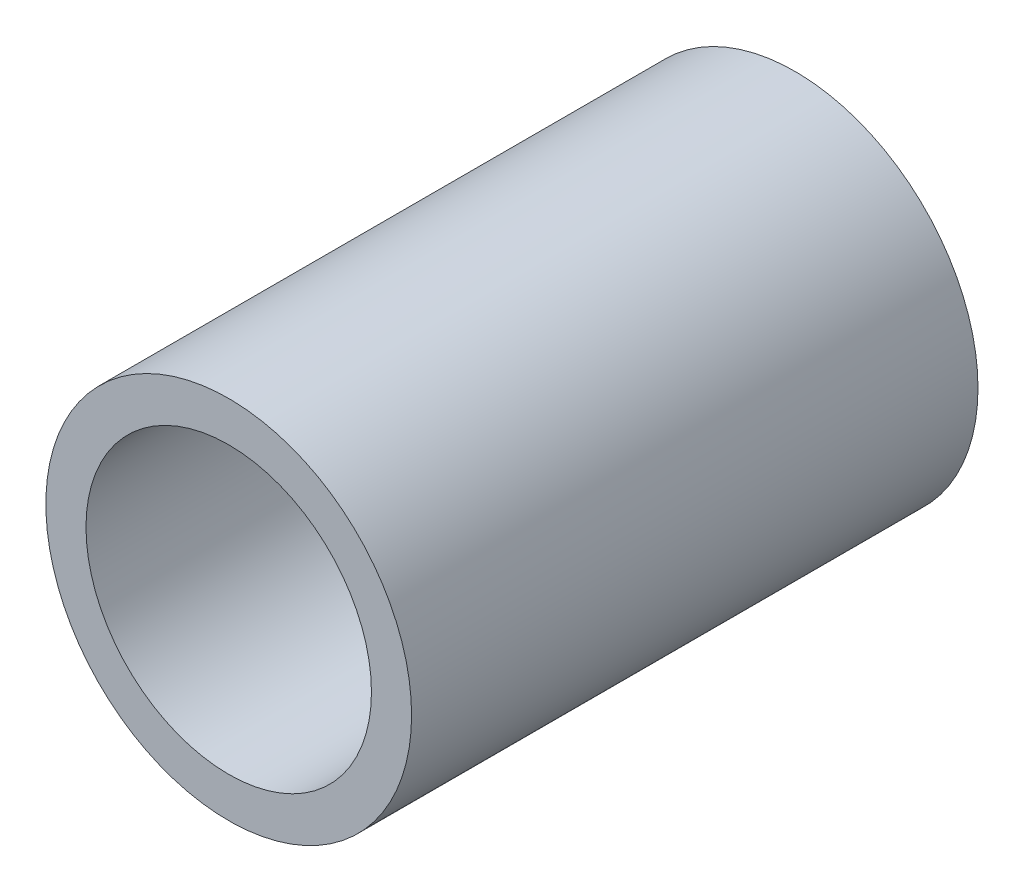
ISO-10303-21;
HEADER;
FILE_DESCRIPTION(('STEP AP214'),'2;1');
FILE_NAME('part.step','',(''),(''),'','','');
FILE_SCHEMA(('AUTOMOTIVE_DESIGN { 1 0 10303 214 1 1 1 1 }'));
ENDSEC;
DATA;
#1=APPLICATION_CONTEXT('core data for automotive mechanical design processes');
#2=APPLICATION_PROTOCOL_DEFINITION('international standard','automotive_design',2000,#1);
#3=PRODUCT_CONTEXT('',#1,'mechanical');
#4=PRODUCT('Part','Part','',(#3));
#5=PRODUCT_RELATED_PRODUCT_CATEGORY('part','',(#4));
#6=PRODUCT_DEFINITION_FORMATION('','',#4);
#7=PRODUCT_DEFINITION_CONTEXT('part definition',#1,'design');
#8=PRODUCT_DEFINITION('design','',#6,#7);
#9=PRODUCT_DEFINITION_SHAPE('','',#8);
#10=(LENGTH_UNIT() NAMED_UNIT(*) SI_UNIT(.MILLI.,.METRE.));
#11=(NAMED_UNIT(*) PLANE_ANGLE_UNIT() SI_UNIT($,.RADIAN.));
#12=(NAMED_UNIT(*) SI_UNIT($,.STERADIAN.) SOLID_ANGLE_UNIT());
#13=UNCERTAINTY_MEASURE_WITH_UNIT(LENGTH_MEASURE(1.E-05),#10,'distance_accuracy_value','');
#14=(GEOMETRIC_REPRESENTATION_CONTEXT(3) GLOBAL_UNCERTAINTY_ASSIGNED_CONTEXT((#13)) GLOBAL_UNIT_ASSIGNED_CONTEXT((#10,
#11,#12)) REPRESENTATION_CONTEXT('',''));
#15=CARTESIAN_POINT('',(0.,0.,0.));
#16=DIRECTION('',(0.,0.,1.));
#17=DIRECTION('',(1.,0.,0.));
#18=AXIS2_PLACEMENT_3D('',#15,#16,#17);
#19=CARTESIAN_POINT('',(0.,0.,-11.1125));
#20=DIRECTION('',(0.,0.,1.));
#21=DIRECTION('',(1.,0.,0.));
#22=AXIS2_PLACEMENT_3D('',#19,#20,#21);
#23=CYLINDRICAL_SURFACE('',#22,7.1755);
#24=CARTESIAN_POINT('',(0.,0.,11.1125));
#25=DIRECTION('',(0.,0.,1.));
#26=DIRECTION('',(1.,0.,0.));
#27=AXIS2_PLACEMENT_3D('',#24,#25,#26);
#28=CIRCLE('',#27,7.1755);
#29=CARTESIAN_POINT('',(7.1755,0.,11.1125));
#30=VERTEX_POINT('',#29);
#31=EDGE_CURVE('E10',#30,#30,#28,.T.);
#32=ORIENTED_EDGE('',*,*,#31,.F.);
#33=EDGE_LOOP('',(#32));
#34=FACE_BOUND('',#33,.T.);
#35=CARTESIAN_POINT('',(0.,0.,-11.1125));
#36=DIRECTION('',(0.,0.,1.));
#37=DIRECTION('',(1.,0.,0.));
#38=AXIS2_PLACEMENT_3D('',#35,#36,#37);
#39=CIRCLE('',#38,7.1755);
#40=CARTESIAN_POINT('',(7.1755,0.,-11.1125));
#41=VERTEX_POINT('',#40);
#42=EDGE_CURVE('E45',#41,#41,#39,.T.);
#43=ORIENTED_EDGE('',*,*,#42,.T.);
#44=EDGE_LOOP('',(#43));
#45=FACE_BOUND('',#44,.T.);
#46=ADVANCED_FACE('F31',(#34,#45),#23,.T.);
#47=CARTESIAN_POINT('',(0.,7.1755,11.1125));
#48=DIRECTION('',(0.,0.,-1.));
#49=DIRECTION('',(-1.,0.,0.));
#50=AXIS2_PLACEMENT_3D('',#47,#48,#49);
#51=PLANE('',#50);
#52=CARTESIAN_POINT('',(0.,0.,11.1125));
#53=DIRECTION('',(0.,0.,1.));
#54=DIRECTION('',(1.,0.,0.));
#55=AXIS2_PLACEMENT_3D('',#52,#53,#54);
#56=CIRCLE('',#55,5.6007);
#57=CARTESIAN_POINT('',(5.6007,0.,11.1125));
#58=VERTEX_POINT('',#57);
#59=EDGE_CURVE('E37',#58,#58,#56,.T.);
#60=ORIENTED_EDGE('',*,*,#59,.F.);
#61=EDGE_LOOP('',(#60));
#62=FACE_BOUND('',#61,.T.);
#63=ORIENTED_EDGE('',*,*,#31,.T.);
#64=EDGE_LOOP('',(#63));
#65=FACE_BOUND('',#64,.T.);
#66=ADVANCED_FACE('F60',(#62,#65),#51,.F.);
#67=CARTESIAN_POINT('',(0.,0.,-11.1125));
#68=DIRECTION('',(0.,0.,1.));
#69=DIRECTION('',(1.,0.,0.));
#70=AXIS2_PLACEMENT_3D('',#67,#68,#69);
#71=CYLINDRICAL_SURFACE('',#70,5.6007);
#72=CARTESIAN_POINT('',(0.,0.,-11.1125));
#73=DIRECTION('',(0.,0.,1.));
#74=DIRECTION('',(1.,0.,0.));
#75=AXIS2_PLACEMENT_3D('',#72,#73,#74);
#76=CIRCLE('',#75,5.6007);
#77=CARTESIAN_POINT('',(5.6007,0.,-11.1125));
#78=VERTEX_POINT('',#77);
#79=EDGE_CURVE('E41',#78,#78,#76,.T.);
#80=ORIENTED_EDGE('',*,*,#79,.F.);
#81=EDGE_LOOP('',(#80));
#82=FACE_BOUND('',#81,.T.);
#83=ORIENTED_EDGE('',*,*,#59,.T.);
#84=EDGE_LOOP('',(#83));
#85=FACE_BOUND('',#84,.T.);
#86=ADVANCED_FACE('F55',(#82,#85),#71,.F.);
#87=CARTESIAN_POINT('',(0.,5.6007,-11.1125));
#88=DIRECTION('',(0.,0.,1.));
#89=DIRECTION('',(1.,0.,0.));
#90=AXIS2_PLACEMENT_3D('',#87,#88,#89);
#91=PLANE('',#90);
#92=ORIENTED_EDGE('',*,*,#42,.F.);
#93=EDGE_LOOP('',(#92));
#94=FACE_BOUND('',#93,.T.);
#95=ORIENTED_EDGE('',*,*,#79,.T.);
#96=EDGE_LOOP('',(#95));
#97=FACE_BOUND('',#96,.T.);
#98=ADVANCED_FACE('F52',(#94,#97),#91,.F.);
#99=CLOSED_SHELL('',(#46,#66,#86,#98));
#100=MANIFOLD_SOLID_BREP('B2',#99);
#101=ADVANCED_BREP_SHAPE_REPRESENTATION('',(#18,#100),#14);
#102=SHAPE_DEFINITION_REPRESENTATION(#9,#101);
ENDSEC;
END-ISO-10303-21;
